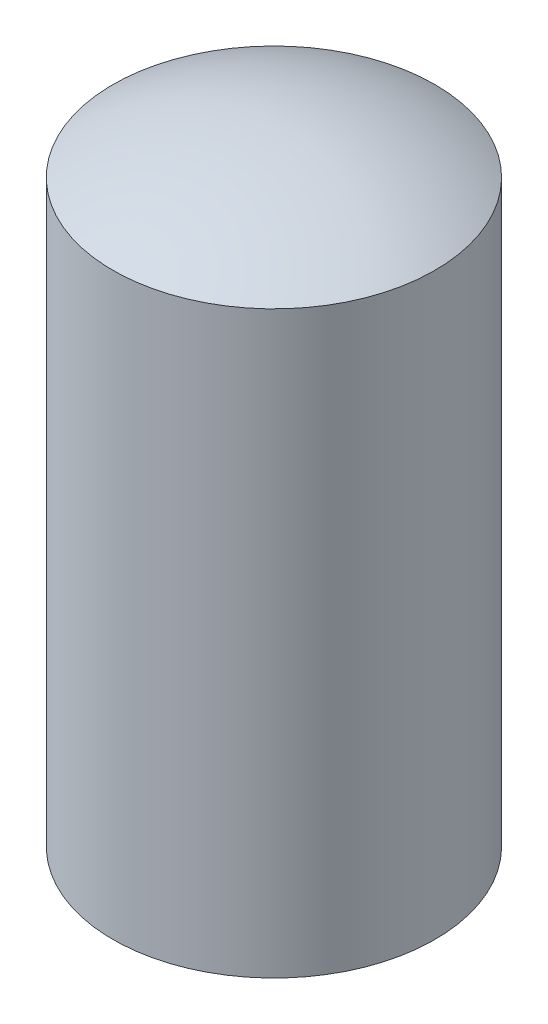
ISO-10303-21;
HEADER;
FILE_DESCRIPTION(('STEP AP214'),'2;1');
FILE_NAME('part.step','',(''),(''),'','','');
FILE_SCHEMA(('AUTOMOTIVE_DESIGN { 1 0 10303 214 1 1 1 1 }'));
ENDSEC;
DATA;
#1=APPLICATION_CONTEXT('core data for automotive mechanical design processes');
#2=APPLICATION_PROTOCOL_DEFINITION('international standard','automotive_design',2000,#1);
#3=PRODUCT_CONTEXT('',#1,'mechanical');
#4=PRODUCT('Part','Part','',(#3));
#5=PRODUCT_RELATED_PRODUCT_CATEGORY('part','',(#4));
#6=PRODUCT_DEFINITION_FORMATION('','',#4);
#7=PRODUCT_DEFINITION_CONTEXT('part definition',#1,'design');
#8=PRODUCT_DEFINITION('design','',#6,#7);
#9=PRODUCT_DEFINITION_SHAPE('','',#8);
#10=(LENGTH_UNIT() NAMED_UNIT(*) SI_UNIT(.MILLI.,.METRE.));
#11=(NAMED_UNIT(*) PLANE_ANGLE_UNIT() SI_UNIT($,.RADIAN.));
#12=(NAMED_UNIT(*) SI_UNIT($,.STERADIAN.) SOLID_ANGLE_UNIT());
#13=UNCERTAINTY_MEASURE_WITH_UNIT(LENGTH_MEASURE(1.E-05),#10,'distance_accuracy_value','');
#14=(GEOMETRIC_REPRESENTATION_CONTEXT(3) GLOBAL_UNCERTAINTY_ASSIGNED_CONTEXT((#13)) GLOBAL_UNIT_ASSIGNED_CONTEXT((#10,
#11,#12)) REPRESENTATION_CONTEXT('',''));
#15=CARTESIAN_POINT('',(0.,0.,0.));
#16=DIRECTION('',(0.,0.,1.));
#17=DIRECTION('',(1.,0.,0.));
#18=AXIS2_PLACEMENT_3D('',#15,#16,#17);
#19=CARTESIAN_POINT('',(0.,27.6019237886467,0.9));
#20=DIRECTION('',(1.,0.,0.));
#21=DIRECTION('',(0.,1.,0.));
#22=AXIS2_PLACEMENT_3D('',#19,#20,#21);
#23=SPHERICAL_SURFACE('',#22,3.);
#24=CARTESIAN_POINT('',(0.,27.6019237886467,0.9));
#25=DIRECTION('',(0.,-1.,0.));
#26=DIRECTION('',(0.,0.,-1.));
#27=AXIS2_PLACEMENT_3D('',#24,#25,#26);
#28=SPHERICAL_SURFACE('',#27,3.);
#29=CARTESIAN_POINT('',(0.,30.2,0.9));
#30=DIRECTION('',(0.,-1.,0.));
#31=DIRECTION('',(0.,0.,-1.));
#32=AXIS2_PLACEMENT_3D('',#29,#30,#31);
#33=CIRCLE('',#32,1.5);
#34=CARTESIAN_POINT('',(0.,30.2,-0.6));
#35=VERTEX_POINT('',#34);
#36=EDGE_CURVE('E11',#35,#35,#33,.T.);
#37=ORIENTED_EDGE('',*,*,#36,.F.);
#38=EDGE_LOOP('',(#37));
#39=FACE_BOUND('',#38,.T.);
#40=ADVANCED_FACE('F17',(#39),#28,.T.);
#41=CARTESIAN_POINT('',(0.,27.3980762113533,0.9));
#42=DIRECTION('',(1.,0.,0.));
#43=DIRECTION('',(0.,-1.,0.));
#44=AXIS2_PLACEMENT_3D('',#41,#42,#43);
#45=SPHERICAL_SURFACE('',#44,3.);
#46=CARTESIAN_POINT('',(0.,27.3980762113533,0.9));
#47=DIRECTION('',(0.,-1.,0.));
#48=DIRECTION('',(0.,0.,-1.));
#49=AXIS2_PLACEMENT_3D('',#46,#47,#48);
#50=SPHERICAL_SURFACE('',#49,3.);
#51=CARTESIAN_POINT('',(0.,24.8,0.9));
#52=DIRECTION('',(0.,-1.,0.));
#53=DIRECTION('',(0.,0.,-1.));
#54=AXIS2_PLACEMENT_3D('',#51,#52,#53);
#55=CIRCLE('',#54,1.5);
#56=CARTESIAN_POINT('',(0.,24.8,-0.6));
#57=VERTEX_POINT('',#56);
#58=EDGE_CURVE('E20',#57,#57,#55,.T.);
#59=ORIENTED_EDGE('',*,*,#58,.T.);
#60=EDGE_LOOP('',(#59));
#61=FACE_BOUND('',#60,.T.);
#62=ADVANCED_FACE('F39',(#61),#50,.T.);
#63=CARTESIAN_POINT('',(0.,26.15,0.9));
#64=DIRECTION('',(0.,-1.,0.));
#65=DIRECTION('',(0.,0.,-1.));
#66=AXIS2_PLACEMENT_3D('',#63,#64,#65);
#67=CYLINDRICAL_SURFACE('',#66,1.5);
#68=ORIENTED_EDGE('',*,*,#36,.T.);
#69=EDGE_LOOP('',(#68));
#70=FACE_BOUND('',#69,.T.);
#71=ORIENTED_EDGE('',*,*,#58,.F.);
#72=EDGE_LOOP('',(#71));
#73=FACE_BOUND('',#72,.T.);
#74=ADVANCED_FACE('F51',(#70,#73),#67,.T.);
#75=CLOSED_SHELL('',(#40,#62,#74));
#76=MANIFOLD_SOLID_BREP('B1',#75);
#77=ADVANCED_BREP_SHAPE_REPRESENTATION('',(#18,#76),#14);
#78=SHAPE_DEFINITION_REPRESENTATION(#9,#77);
ENDSEC;
END-ISO-10303-21;
